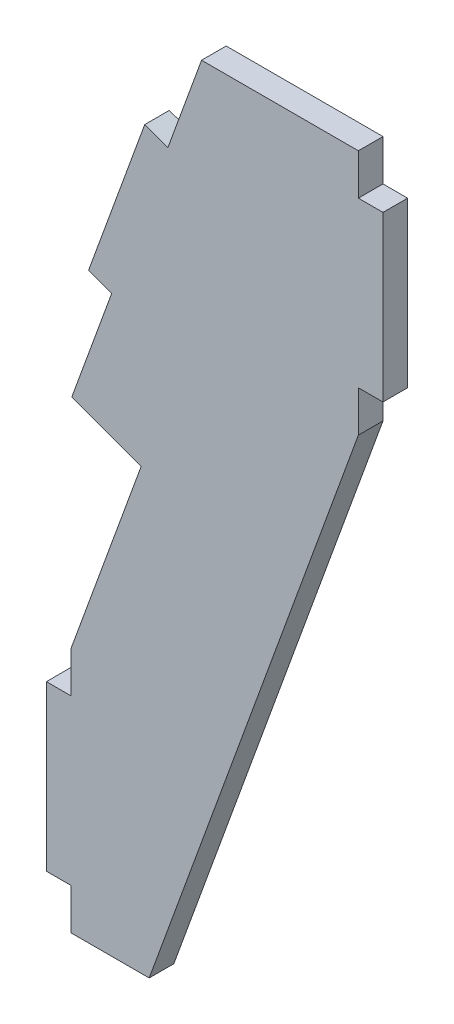
ISO-10303-21;
HEADER;
FILE_DESCRIPTION(('STEP AP214'),'2;1');
FILE_NAME('part.step','',(''),(''),'','','');
FILE_SCHEMA(('AUTOMOTIVE_DESIGN { 1 0 10303 214 1 1 1 1 }'));
ENDSEC;
DATA;
#1=APPLICATION_CONTEXT('core data for automotive mechanical design processes');
#2=APPLICATION_PROTOCOL_DEFINITION('international standard','automotive_design',2000,#1);
#3=PRODUCT_CONTEXT('',#1,'mechanical');
#4=PRODUCT('Part','Part','',(#3));
#5=PRODUCT_RELATED_PRODUCT_CATEGORY('part','',(#4));
#6=PRODUCT_DEFINITION_FORMATION('','',#4);
#7=PRODUCT_DEFINITION_CONTEXT('part definition',#1,'design');
#8=PRODUCT_DEFINITION('design','',#6,#7);
#9=PRODUCT_DEFINITION_SHAPE('','',#8);
#10=(LENGTH_UNIT() NAMED_UNIT(*) SI_UNIT(.MILLI.,.METRE.));
#11=(NAMED_UNIT(*) PLANE_ANGLE_UNIT() SI_UNIT($,.RADIAN.));
#12=(NAMED_UNIT(*) SI_UNIT($,.STERADIAN.) SOLID_ANGLE_UNIT());
#13=UNCERTAINTY_MEASURE_WITH_UNIT(LENGTH_MEASURE(1.E-05),#10,'distance_accuracy_value','');
#14=(GEOMETRIC_REPRESENTATION_CONTEXT(3) GLOBAL_UNCERTAINTY_ASSIGNED_CONTEXT((#13)) GLOBAL_UNIT_ASSIGNED_CONTEXT((#10,
#11,#12)) REPRESENTATION_CONTEXT('',''));
#15=CARTESIAN_POINT('',(0.,0.,0.));
#16=DIRECTION('',(0.,0.,1.));
#17=DIRECTION('',(1.,0.,0.));
#18=AXIS2_PLACEMENT_3D('',#15,#16,#17);
#19=CARTESIAN_POINT('',(3.,25.,3.));
#20=DIRECTION('',(1.,0.,0.));
#21=DIRECTION('',(0.,1.,0.));
#22=AXIS2_PLACEMENT_3D('',#19,#20,#21);
#23=PLANE('',#22);
#24=DIRECTION('',(0.,-1.,0.));
#25=VECTOR('',#24,1.);
#26=CARTESIAN_POINT('',(3.,25.,0.));
#27=LINE('',#26,#25);
#28=CARTESIAN_POINT('',(3.,25.,0.));
#29=VERTEX_POINT('',#28);
#30=CARTESIAN_POINT('',(3.,20.,0.));
#31=VERTEX_POINT('',#30);
#32=EDGE_CURVE('E184',#29,#31,#27,.T.);
#33=ORIENTED_EDGE('',*,*,#32,.T.);
#34=DIRECTION('',(0.,0.,-1.));
#35=VECTOR('',#34,1.);
#36=CARTESIAN_POINT('',(3.,20.,3.));
#37=LINE('',#36,#35);
#38=CARTESIAN_POINT('',(3.,20.,3.));
#39=VERTEX_POINT('',#38);
#40=EDGE_CURVE('E11',#39,#31,#37,.T.);
#41=ORIENTED_EDGE('',*,*,#40,.F.);
#42=DIRECTION('',(0.,-1.,0.));
#43=VECTOR('',#42,1.);
#44=CARTESIAN_POINT('',(3.,25.,3.));
#45=LINE('',#44,#43);
#46=CARTESIAN_POINT('',(3.,25.,3.));
#47=VERTEX_POINT('',#46);
#48=EDGE_CURVE('E212',#47,#39,#45,.T.);
#49=ORIENTED_EDGE('',*,*,#48,.F.);
#50=DIRECTION('',(0.,0.,-1.));
#51=VECTOR('',#50,1.);
#52=CARTESIAN_POINT('',(3.,25.,3.));
#53=LINE('',#52,#51);
#54=EDGE_CURVE('E183',#47,#29,#53,.T.);
#55=ORIENTED_EDGE('',*,*,#54,.T.);
#56=EDGE_LOOP('',(#33,#41,#49,#55));
#57=FACE_BOUND('',#56,.T.);
#58=ADVANCED_FACE('F35',(#57),#23,.F.);
#59=CARTESIAN_POINT('',(3.,20.,3.));
#60=DIRECTION('',(0.,-1.,0.));
#61=DIRECTION('',(1.,0.,0.));
#62=AXIS2_PLACEMENT_3D('',#59,#60,#61);
#63=PLANE('',#62);
#64=DIRECTION('',(-1.,0.,0.));
#65=VECTOR('',#64,1.);
#66=CARTESIAN_POINT('',(3.,20.,0.));
#67=LINE('',#66,#65);
#68=CARTESIAN_POINT('',(0.,20.,0.));
#69=VERTEX_POINT('',#68);
#70=EDGE_CURVE('E187',#31,#69,#67,.T.);
#71=ORIENTED_EDGE('',*,*,#70,.T.);
#72=DIRECTION('',(0.,0.,-1.));
#73=VECTOR('',#72,1.);
#74=CARTESIAN_POINT('',(0.,20.,3.));
#75=LINE('',#74,#73);
#76=CARTESIAN_POINT('',(0.,20.,3.));
#77=VERTEX_POINT('',#76);
#78=EDGE_CURVE('E43',#77,#69,#75,.T.);
#79=ORIENTED_EDGE('',*,*,#78,.F.);
#80=DIRECTION('',(-1.,0.,0.));
#81=VECTOR('',#80,1.);
#82=CARTESIAN_POINT('',(3.,20.,3.));
#83=LINE('',#82,#81);
#84=EDGE_CURVE('E113',#39,#77,#83,.T.);
#85=ORIENTED_EDGE('',*,*,#84,.F.);
#86=ORIENTED_EDGE('',*,*,#40,.T.);
#87=EDGE_LOOP('',(#71,#79,#85,#86));
#88=FACE_BOUND('',#87,.T.);
#89=ADVANCED_FACE('F318',(#88),#63,.F.);
#90=CARTESIAN_POINT('',(0.,20.,3.));
#91=DIRECTION('',(1.,0.,0.));
#92=DIRECTION('',(0.,1.,0.));
#93=AXIS2_PLACEMENT_3D('',#90,#91,#92);
#94=PLANE('',#93);
#95=DIRECTION('',(0.,-1.,0.));
#96=VECTOR('',#95,1.);
#97=CARTESIAN_POINT('',(0.,20.,0.));
#98=LINE('',#97,#96);
#99=CARTESIAN_POINT('',(0.,0.,0.));
#100=VERTEX_POINT('',#99);
#101=EDGE_CURVE('E189',#69,#100,#98,.T.);
#102=ORIENTED_EDGE('',*,*,#101,.T.);
#103=DIRECTION('',(0.,0.,-1.));
#104=VECTOR('',#103,1.);
#105=CARTESIAN_POINT('',(0.,0.,3.));
#106=LINE('',#105,#104);
#107=CARTESIAN_POINT('',(0.,0.,3.));
#108=VERTEX_POINT('',#107);
#109=EDGE_CURVE('E237',#108,#100,#106,.T.);
#110=ORIENTED_EDGE('',*,*,#109,.F.);
#111=DIRECTION('',(0.,-1.,0.));
#112=VECTOR('',#111,1.);
#113=CARTESIAN_POINT('',(0.,20.,3.));
#114=LINE('',#113,#112);
#115=EDGE_CURVE('E245',#77,#108,#114,.T.);
#116=ORIENTED_EDGE('',*,*,#115,.F.);
#117=ORIENTED_EDGE('',*,*,#78,.T.);
#118=EDGE_LOOP('',(#102,#110,#116,#117));
#119=FACE_BOUND('',#118,.T.);
#120=ADVANCED_FACE('F243',(#119),#94,.F.);
#121=CARTESIAN_POINT('',(0.,0.,3.));
#122=DIRECTION('',(0.,1.,0.));
#123=DIRECTION('',(0.,0.,1.));
#124=AXIS2_PLACEMENT_3D('',#121,#122,#123);
#125=PLANE('',#124);
#126=DIRECTION('',(1.,0.,0.));
#127=VECTOR('',#126,1.);
#128=CARTESIAN_POINT('',(0.,0.,0.));
#129=LINE('',#128,#127);
#130=CARTESIAN_POINT('',(3.,0.,0.));
#131=VERTEX_POINT('',#130);
#132=EDGE_CURVE('E191',#100,#131,#129,.T.);
#133=ORIENTED_EDGE('',*,*,#132,.T.);
#134=DIRECTION('',(0.,0.,-1.));
#135=VECTOR('',#134,1.);
#136=CARTESIAN_POINT('',(3.,0.,3.));
#137=LINE('',#136,#135);
#138=CARTESIAN_POINT('',(3.,0.,3.));
#139=VERTEX_POINT('',#138);
#140=EDGE_CURVE('E234',#139,#131,#137,.T.);
#141=ORIENTED_EDGE('',*,*,#140,.F.);
#142=DIRECTION('',(1.,0.,0.));
#143=VECTOR('',#142,1.);
#144=CARTESIAN_POINT('',(0.,0.,3.));
#145=LINE('',#144,#143);
#146=EDGE_CURVE('E263',#108,#139,#145,.T.);
#147=ORIENTED_EDGE('',*,*,#146,.F.);
#148=ORIENTED_EDGE('',*,*,#109,.T.);
#149=EDGE_LOOP('',(#133,#141,#147,#148));
#150=FACE_BOUND('',#149,.T.);
#151=ADVANCED_FACE('F254',(#150),#125,.F.);
#152=CARTESIAN_POINT('',(3.,0.,3.));
#153=DIRECTION('',(1.,0.,0.));
#154=DIRECTION('',(0.,1.,0.));
#155=AXIS2_PLACEMENT_3D('',#152,#153,#154);
#156=PLANE('',#155);
#157=DIRECTION('',(0.,-1.,0.));
#158=VECTOR('',#157,1.);
#159=CARTESIAN_POINT('',(3.,0.,0.));
#160=LINE('',#159,#158);
#161=CARTESIAN_POINT('',(3.,-5.,0.));
#162=VERTEX_POINT('',#161);
#163=EDGE_CURVE('E193',#131,#162,#160,.T.);
#164=ORIENTED_EDGE('',*,*,#163,.T.);
#165=DIRECTION('',(0.,0.,-1.));
#166=VECTOR('',#165,1.);
#167=CARTESIAN_POINT('',(3.,-5.,3.));
#168=LINE('',#167,#166);
#169=CARTESIAN_POINT('',(3.,-5.,3.));
#170=VERTEX_POINT('',#169);
#171=EDGE_CURVE('E231',#170,#162,#168,.T.);
#172=ORIENTED_EDGE('',*,*,#171,.F.);
#173=DIRECTION('',(0.,-1.,0.));
#174=VECTOR('',#173,1.);
#175=CARTESIAN_POINT('',(3.,0.,3.));
#176=LINE('',#175,#174);
#177=EDGE_CURVE('E260',#139,#170,#176,.T.);
#178=ORIENTED_EDGE('',*,*,#177,.F.);
#179=ORIENTED_EDGE('',*,*,#140,.T.);
#180=EDGE_LOOP('',(#164,#172,#178,#179));
#181=FACE_BOUND('',#180,.T.);
#182=ADVANCED_FACE('F258',(#181),#156,.F.);
#183=CARTESIAN_POINT('',(3.,-5.,3.));
#184=DIRECTION('',(0.,1.,0.));
#185=DIRECTION('',(0.,0.,1.));
#186=AXIS2_PLACEMENT_3D('',#183,#184,#185);
#187=PLANE('',#186);
#188=DIRECTION('',(1.,0.,0.));
#189=VECTOR('',#188,1.);
#190=CARTESIAN_POINT('',(3.,-5.,0.));
#191=LINE('',#190,#189);
#192=CARTESIAN_POINT('',(12.5220836022957,-5.,0.));
#193=VERTEX_POINT('',#192);
#194=EDGE_CURVE('E195',#162,#193,#191,.T.);
#195=ORIENTED_EDGE('',*,*,#194,.T.);
#196=DIRECTION('',(0.,0.,-1.));
#197=VECTOR('',#196,1.);
#198=CARTESIAN_POINT('',(12.5220836022957,-5.,3.));
#199=LINE('',#198,#197);
#200=CARTESIAN_POINT('',(12.5220836022957,-5.,3.));
#201=VERTEX_POINT('',#200);
#202=EDGE_CURVE('E228',#201,#193,#199,.T.);
#203=ORIENTED_EDGE('',*,*,#202,.F.);
#204=DIRECTION('',(1.,0.,0.));
#205=VECTOR('',#204,1.);
#206=CARTESIAN_POINT('',(3.,-5.,3.));
#207=LINE('',#206,#205);
#208=EDGE_CURVE('E262',#170,#201,#207,.T.);
#209=ORIENTED_EDGE('',*,*,#208,.F.);
#210=ORIENTED_EDGE('',*,*,#171,.T.);
#211=EDGE_LOOP('',(#195,#203,#209,#210));
#212=FACE_BOUND('',#211,.T.);
#213=ADVANCED_FACE('F330',(#212),#187,.F.);
#214=CARTESIAN_POINT('',(12.5220836022957,-5.,3.));
#215=DIRECTION('',(-0.939692620785908,0.342020143325669,0.));
#216=DIRECTION('',(-0.342020143325669,-0.939692620785908,0.));
#217=AXIS2_PLACEMENT_3D('',#214,#215,#216);
#218=PLANE('',#217);
#219=DIRECTION('',(0.342020143325669,0.939692620785908,0.));
#220=VECTOR('',#219,1.);
#221=CARTESIAN_POINT('',(12.5220836022957,-5.,0.));
#222=LINE('',#221,#220);
#223=CARTESIAN_POINT('',(38.0000000009301,65.0000000000005,0.));
#224=VERTEX_POINT('',#223);
#225=EDGE_CURVE('E197',#193,#224,#222,.T.);
#226=ORIENTED_EDGE('',*,*,#225,.T.);
#227=DIRECTION('',(0.,0.,-1.));
#228=VECTOR('',#227,1.);
#229=CARTESIAN_POINT('',(38.0000000009301,65.0000000000005,3.));
#230=LINE('',#229,#228);
#231=CARTESIAN_POINT('',(38.0000000009301,65.0000000000005,3.));
#232=VERTEX_POINT('',#231);
#233=EDGE_CURVE('E225',#232,#224,#230,.T.);
#234=ORIENTED_EDGE('',*,*,#233,.F.);
#235=DIRECTION('',(0.342020143325669,0.939692620785908,0.));
#236=VECTOR('',#235,1.);
#237=CARTESIAN_POINT('',(12.5220836022957,-5.,3.));
#238=LINE('',#237,#236);
#239=EDGE_CURVE('E265',#201,#232,#238,.T.);
#240=ORIENTED_EDGE('',*,*,#239,.F.);
#241=ORIENTED_EDGE('',*,*,#202,.T.);
#242=EDGE_LOOP('',(#226,#234,#240,#241));
#243=FACE_BOUND('',#242,.T.);
#244=ADVANCED_FACE('F333',(#243),#218,.F.);
#245=CARTESIAN_POINT('',(38.0000000009301,65.0000000000005,3.));
#246=DIRECTION('',(-1.,0.,0.));
#247=DIRECTION('',(0.,0.,1.));
#248=AXIS2_PLACEMENT_3D('',#245,#246,#247);
#249=PLANE('',#248);
#250=DIRECTION('',(0.,1.,0.));
#251=VECTOR('',#250,1.);
#252=CARTESIAN_POINT('',(38.0000000009301,65.0000000000005,0.));
#253=LINE('',#252,#251);
#254=CARTESIAN_POINT('',(38.0000000009301,70.0000000000004,0.));
#255=VERTEX_POINT('',#254);
#256=EDGE_CURVE('E199',#224,#255,#253,.T.);
#257=ORIENTED_EDGE('',*,*,#256,.T.);
#258=DIRECTION('',(0.,0.,-1.));
#259=VECTOR('',#258,1.);
#260=CARTESIAN_POINT('',(38.0000000009301,70.0000000000004,3.));
#261=LINE('',#260,#259);
#262=CARTESIAN_POINT('',(38.0000000009301,70.0000000000004,3.));
#263=VERTEX_POINT('',#262);
#264=EDGE_CURVE('E222',#263,#255,#261,.T.);
#265=ORIENTED_EDGE('',*,*,#264,.F.);
#266=DIRECTION('',(0.,1.,0.));
#267=VECTOR('',#266,1.);
#268=CARTESIAN_POINT('',(38.0000000009301,65.0000000000005,3.));
#269=LINE('',#268,#267);
#270=EDGE_CURVE('E271',#232,#263,#269,.T.);
#271=ORIENTED_EDGE('',*,*,#270,.F.);
#272=ORIENTED_EDGE('',*,*,#233,.T.);
#273=EDGE_LOOP('',(#257,#265,#271,#272));
#274=FACE_BOUND('',#273,.T.);
#275=ADVANCED_FACE('F337',(#274),#249,.F.);
#276=CARTESIAN_POINT('',(38.0000000009301,70.0000000000004,3.));
#277=DIRECTION('',(0.,1.,0.));
#278=DIRECTION('',(0.,0.,1.));
#279=AXIS2_PLACEMENT_3D('',#276,#277,#278);
#280=PLANE('',#279);
#281=DIRECTION('',(1.,0.,0.));
#282=VECTOR('',#281,1.);
#283=CARTESIAN_POINT('',(38.0000000009301,70.0000000000004,0.));
#284=LINE('',#283,#282);
#285=CARTESIAN_POINT('',(41.,70.0000000000004,0.));
#286=VERTEX_POINT('',#285);
#287=EDGE_CURVE('E201',#255,#286,#284,.T.);
#288=ORIENTED_EDGE('',*,*,#287,.T.);
#289=DIRECTION('',(0.,0.,-1.));
#290=VECTOR('',#289,1.);
#291=CARTESIAN_POINT('',(41.,70.0000000000004,3.));
#292=LINE('',#291,#290);
#293=CARTESIAN_POINT('',(41.,70.0000000000004,3.));
#294=VERTEX_POINT('',#293);
#295=EDGE_CURVE('E219',#294,#286,#292,.T.);
#296=ORIENTED_EDGE('',*,*,#295,.F.);
#297=DIRECTION('',(1.,0.,0.));
#298=VECTOR('',#297,1.);
#299=CARTESIAN_POINT('',(38.0000000009301,70.0000000000004,3.));
#300=LINE('',#299,#298);
#301=EDGE_CURVE('E273',#263,#294,#300,.T.);
#302=ORIENTED_EDGE('',*,*,#301,.F.);
#303=ORIENTED_EDGE('',*,*,#264,.T.);
#304=EDGE_LOOP('',(#288,#296,#302,#303));
#305=FACE_BOUND('',#304,.T.);
#306=ADVANCED_FACE('F341',(#305),#280,.F.);
#307=CARTESIAN_POINT('',(41.,70.0000000000004,3.));
#308=DIRECTION('',(-1.,0.,0.));
#309=DIRECTION('',(0.,-1.,0.));
#310=AXIS2_PLACEMENT_3D('',#307,#308,#309);
#311=PLANE('',#310);
#312=DIRECTION('',(0.,1.,0.));
#313=VECTOR('',#312,1.);
#314=CARTESIAN_POINT('',(41.,70.0000000000004,0.));
#315=LINE('',#314,#313);
#316=CARTESIAN_POINT('',(41.,89.9999999965894,0.));
#317=VERTEX_POINT('',#316);
#318=EDGE_CURVE('E203',#286,#317,#315,.T.);
#319=ORIENTED_EDGE('',*,*,#318,.T.);
#320=DIRECTION('',(0.,0.,-1.));
#321=VECTOR('',#320,1.);
#322=CARTESIAN_POINT('',(41.,89.9999999965894,3.));
#323=LINE('',#322,#321);
#324=CARTESIAN_POINT('',(41.,89.9999999965894,3.));
#325=VERTEX_POINT('',#324);
#326=EDGE_CURVE('E216',#325,#317,#323,.T.);
#327=ORIENTED_EDGE('',*,*,#326,.F.);
#328=DIRECTION('',(0.,1.,0.));
#329=VECTOR('',#328,1.);
#330=CARTESIAN_POINT('',(41.,70.0000000000004,3.));
#331=LINE('',#330,#329);
#332=EDGE_CURVE('E275',#294,#325,#331,.T.);
#333=ORIENTED_EDGE('',*,*,#332,.F.);
#334=ORIENTED_EDGE('',*,*,#295,.T.);
#335=EDGE_LOOP('',(#319,#327,#333,#334));
#336=FACE_BOUND('',#335,.T.);
#337=ADVANCED_FACE('F281',(#336),#311,.F.);
#338=CARTESIAN_POINT('',(41.,89.9999999965894,3.));
#339=DIRECTION('',(0.,-1.,0.));
#340=DIRECTION('',(1.,0.,0.));
#341=AXIS2_PLACEMENT_3D('',#338,#339,#340);
#342=PLANE('',#341);
#343=DIRECTION('',(-1.,0.,0.));
#344=VECTOR('',#343,1.);
#345=CARTESIAN_POINT('',(41.,89.9999999965894,0.));
#346=LINE('',#345,#344);
#347=CARTESIAN_POINT('',(38.0000000009301,89.9999999965894,0.));
#348=VERTEX_POINT('',#347);
#349=EDGE_CURVE('E205',#317,#348,#346,.T.);
#350=ORIENTED_EDGE('',*,*,#349,.T.);
#351=DIRECTION('',(0.,0.,-1.));
#352=VECTOR('',#351,1.);
#353=CARTESIAN_POINT('',(38.0000000009301,89.9999999965894,3.));
#354=LINE('',#353,#352);
#355=CARTESIAN_POINT('',(38.0000000009301,89.9999999965894,3.));
#356=VERTEX_POINT('',#355);
#357=EDGE_CURVE('E170',#356,#348,#354,.T.);
#358=ORIENTED_EDGE('',*,*,#357,.F.);
#359=DIRECTION('',(-1.,0.,0.));
#360=VECTOR('',#359,1.);
#361=CARTESIAN_POINT('',(41.,89.9999999965894,3.));
#362=LINE('',#361,#360);
#363=EDGE_CURVE('E157',#325,#356,#362,.T.);
#364=ORIENTED_EDGE('',*,*,#363,.F.);
#365=ORIENTED_EDGE('',*,*,#326,.T.);
#366=EDGE_LOOP('',(#350,#358,#364,#365));
#367=FACE_BOUND('',#366,.T.);
#368=ADVANCED_FACE('F285',(#367),#342,.F.);
#369=CARTESIAN_POINT('',(38.0000000009301,89.9999999965894,3.));
#370=DIRECTION('',(-1.,0.,0.));
#371=DIRECTION('',(0.,0.,1.));
#372=AXIS2_PLACEMENT_3D('',#369,#370,#371);
#373=PLANE('',#372);
#374=DIRECTION('',(0.,1.,0.));
#375=VECTOR('',#374,1.);
#376=CARTESIAN_POINT('',(38.0000000009301,89.9999999965894,0.));
#377=LINE('',#376,#375);
#378=CARTESIAN_POINT('',(38.0000000009301,94.9999999965894,0.));
#379=VERTEX_POINT('',#378);
#380=EDGE_CURVE('E166',#348,#379,#377,.T.);
#381=ORIENTED_EDGE('',*,*,#380,.T.);
#382=DIRECTION('',(0.,0.,-1.));
#383=VECTOR('',#382,1.);
#384=CARTESIAN_POINT('',(38.0000000009301,94.9999999965894,3.));
#385=LINE('',#384,#383);
#386=CARTESIAN_POINT('',(38.0000000009301,94.9999999965894,3.));
#387=VERTEX_POINT('',#386);
#388=EDGE_CURVE('E163',#387,#379,#385,.T.);
#389=ORIENTED_EDGE('',*,*,#388,.F.);
#390=DIRECTION('',(0.,1.,0.));
#391=VECTOR('',#390,1.);
#392=CARTESIAN_POINT('',(38.0000000009301,89.9999999965894,3.));
#393=LINE('',#392,#391);
#394=EDGE_CURVE('E148',#356,#387,#393,.T.);
#395=ORIENTED_EDGE('',*,*,#394,.F.);
#396=ORIENTED_EDGE('',*,*,#357,.T.);
#397=EDGE_LOOP('',(#381,#389,#395,#396));
#398=FACE_BOUND('',#397,.T.);
#399=ADVANCED_FACE('F164',(#398),#373,.F.);
#400=CARTESIAN_POINT('',(38.0000000009301,94.9999999965894,3.));
#401=DIRECTION('',(0.,-1.,0.));
#402=DIRECTION('',(0.,0.,-1.));
#403=AXIS2_PLACEMENT_3D('',#400,#401,#402);
#404=PLANE('',#403);
#405=DIRECTION('',(-1.,0.,0.));
#406=VECTOR('',#405,1.);
#407=CARTESIAN_POINT('',(38.0000000009301,94.9999999965894,0.));
#408=LINE('',#407,#406);
#409=CARTESIAN_POINT('',(18.9003164451097,94.9999999965894,0.));
#410=VERTEX_POINT('',#409);
#411=EDGE_CURVE('E208',#379,#410,#408,.T.);
#412=ORIENTED_EDGE('',*,*,#411,.T.);
#413=DIRECTION('',(0.,0.,-1.));
#414=VECTOR('',#413,1.);
#415=CARTESIAN_POINT('',(18.9003164451097,94.9999999965894,3.));
#416=LINE('',#415,#414);
#417=CARTESIAN_POINT('',(18.9003164451097,94.9999999965894,3.));
#418=VERTEX_POINT('',#417);
#419=EDGE_CURVE('E175',#418,#410,#416,.T.);
#420=ORIENTED_EDGE('',*,*,#419,.F.);
#421=DIRECTION('',(-1.,0.,0.));
#422=VECTOR('',#421,1.);
#423=CARTESIAN_POINT('',(38.0000000009301,94.9999999965894,3.));
#424=LINE('',#423,#422);
#425=EDGE_CURVE('E154',#387,#418,#424,.T.);
#426=ORIENTED_EDGE('',*,*,#425,.F.);
#427=ORIENTED_EDGE('',*,*,#388,.T.);
#428=EDGE_LOOP('',(#412,#420,#426,#427));
#429=FACE_BOUND('',#428,.T.);
#430=ADVANCED_FACE('F173',(#429),#404,.F.);
#431=CARTESIAN_POINT('',(8.73142572313329,49.5183759487696,3.));
#432=DIRECTION('',(0.342020143325669,0.939692620785909,0.));
#433=DIRECTION('',(-0.939692620785909,0.342020143325669,0.));
#434=AXIS2_PLACEMENT_3D('',#431,#432,#433);
#435=PLANE('',#434);
#436=DIRECTION('',(0.939692620785908,-0.342020143325669,0.));
#437=VECTOR('',#436,1.);
#438=CARTESIAN_POINT('',(8.73142572313329,49.5183759487696,0.));
#439=LINE('',#438,#437);
#440=CARTESIAN_POINT('',(3.09326999606862,51.5704968095787,0.));
#441=VERTEX_POINT('',#440);
#442=CARTESIAN_POINT('',(11.5505035831417,48.4923155196477,0.));
#443=VERTEX_POINT('',#442);
#444=EDGE_CURVE('E99',#441,#443,#439,.T.);
#445=ORIENTED_EDGE('',*,*,#444,.T.);
#446=DIRECTION('',(0.,0.,-1.));
#447=VECTOR('',#446,1.);
#448=CARTESIAN_POINT('',(11.5505035831417,48.4923155196477,3.));
#449=LINE('',#448,#447);
#450=CARTESIAN_POINT('',(11.5505035831417,48.4923155196477,3.));
#451=VERTEX_POINT('',#450);
#452=EDGE_CURVE('E171',#451,#443,#449,.T.);
#453=ORIENTED_EDGE('',*,*,#452,.F.);
#454=DIRECTION('',(0.939692620785908,-0.342020143325669,0.));
#455=VECTOR('',#454,1.);
#456=CARTESIAN_POINT('',(8.73142572313329,49.5183759487696,3.));
#457=LINE('',#456,#455);
#458=CARTESIAN_POINT('',(3.09326999606862,51.5704968095787,3.));
#459=VERTEX_POINT('',#458);
#460=EDGE_CURVE('E177',#459,#451,#457,.T.);
#461=ORIENTED_EDGE('',*,*,#460,.F.);
#462=DIRECTION('',(0.,0.,-1.));
#463=VECTOR('',#462,1.);
#464=CARTESIAN_POINT('',(3.09326999606862,51.5704968095787,3.));
#465=LINE('',#464,#463);
#466=EDGE_CURVE('E312',#459,#441,#465,.T.);
#467=ORIENTED_EDGE('',*,*,#466,.T.);
#468=EDGE_LOOP('',(#445,#453,#461,#467));
#469=FACE_BOUND('',#468,.T.);
#470=ADVANCED_FACE('F354',(#469),#435,.F.);
#471=CARTESIAN_POINT('',(11.5505035831417,48.4923155196477,3.));
#472=DIRECTION('',(0.939692620785908,-0.342020143325669,0.));
#473=DIRECTION('',(0.342020143325669,0.939692620785908,0.));
#474=AXIS2_PLACEMENT_3D('',#471,#472,#473);
#475=PLANE('',#474);
#476=DIRECTION('',(-0.342020143325669,-0.939692620785908,0.));
#477=VECTOR('',#476,1.);
#478=CARTESIAN_POINT('',(11.5505035831417,48.4923155196477,0.));
#479=LINE('',#478,#477);
#480=EDGE_CURVE('E105',#443,#29,#479,.T.);
#481=ORIENTED_EDGE('',*,*,#480,.T.);
#482=ORIENTED_EDGE('',*,*,#54,.F.);
#483=DIRECTION('',(-0.342020143325669,-0.939692620785908,0.));
#484=VECTOR('',#483,1.);
#485=CARTESIAN_POINT('',(11.5505035831417,48.4923155196477,3.));
#486=LINE('',#485,#484);
#487=EDGE_CURVE('E51',#451,#47,#486,.T.);
#488=ORIENTED_EDGE('',*,*,#487,.F.);
#489=ORIENTED_EDGE('',*,*,#452,.T.);
#490=EDGE_LOOP('',(#481,#482,#488,#489));
#491=FACE_BOUND('',#490,.T.);
#492=ADVANCED_FACE('F357',(#491),#475,.F.);
#493=CARTESIAN_POINT('',(0.,0.,3.));
#494=DIRECTION('',(0.,0.,-1.));
#495=DIRECTION('',(-1.,0.,0.));
#496=AXIS2_PLACEMENT_3D('',#493,#494,#495);
#497=PLANE('',#496);
#498=DIRECTION('',(0.342020143325668,0.939692620785909,0.));
#499=VECTOR('',#498,1.);
#500=CARTESIAN_POINT('',(7.95567185868829,64.9298361314404,3.));
#501=LINE('',#500,#499);
#502=CARTESIAN_POINT('',(7.95567185868829,64.9298361314404,3.));
#503=VERTEX_POINT('',#502);
#504=EDGE_CURVE('E554',#459,#503,#501,.T.);
#505=ORIENTED_EDGE('',*,*,#504,.F.);
#506=ORIENTED_EDGE('',*,*,#460,.T.);
#507=ORIENTED_EDGE('',*,*,#487,.T.);
#508=ORIENTED_EDGE('',*,*,#48,.T.);
#509=ORIENTED_EDGE('',*,*,#84,.T.);
#510=ORIENTED_EDGE('',*,*,#115,.T.);
#511=ORIENTED_EDGE('',*,*,#146,.T.);
#512=ORIENTED_EDGE('',*,*,#177,.T.);
#513=ORIENTED_EDGE('',*,*,#208,.T.);
#514=ORIENTED_EDGE('',*,*,#239,.T.);
#515=ORIENTED_EDGE('',*,*,#270,.T.);
#516=ORIENTED_EDGE('',*,*,#301,.T.);
#517=ORIENTED_EDGE('',*,*,#332,.T.);
#518=ORIENTED_EDGE('',*,*,#363,.T.);
#519=ORIENTED_EDGE('',*,*,#394,.T.);
#520=ORIENTED_EDGE('',*,*,#425,.T.);
#521=DIRECTION('',(0.342020143325668,0.939692620785909,0.));
#522=VECTOR('',#521,1.);
#523=CARTESIAN_POINT('',(14.7960747252017,83.7236885471585,3.));
#524=LINE('',#523,#522);
#525=CARTESIAN_POINT('',(14.7960747252017,83.7236885471585,3.));
#526=VERTEX_POINT('',#525);
#527=EDGE_CURVE('E295',#526,#418,#524,.T.);
#528=ORIENTED_EDGE('',*,*,#527,.F.);
#529=DIRECTION('',(0.939692620785908,-0.342020143325669,0.));
#530=VECTOR('',#529,1.);
#531=CARTESIAN_POINT('',(11.9769968628439,84.7497489771355,3.));
#532=LINE('',#531,#530);
#533=CARTESIAN_POINT('',(11.9769968628439,84.7497489771355,3.));
#534=VERTEX_POINT('',#533);
#535=EDGE_CURVE('E546',#534,#526,#532,.T.);
#536=ORIENTED_EDGE('',*,*,#535,.F.);
#537=DIRECTION('',(0.342020143325668,0.939692620785909,0.));
#538=VECTOR('',#537,1.);
#539=CARTESIAN_POINT('',(5.13659399633057,65.9558965614174,3.));
#540=LINE('',#539,#538);
#541=CARTESIAN_POINT('',(5.13659399633057,65.9558965614174,3.));
#542=VERTEX_POINT('',#541);
#543=EDGE_CURVE('E548',#542,#534,#540,.T.);
#544=ORIENTED_EDGE('',*,*,#543,.F.);
#545=DIRECTION('',(-0.939692620785908,0.34202014332567,0.));
#546=VECTOR('',#545,1.);
#547=CARTESIAN_POINT('',(7.95567185868829,64.9298361314404,3.));
#548=LINE('',#547,#546);
#549=EDGE_CURVE('E551',#503,#542,#548,.T.);
#550=ORIENTED_EDGE('',*,*,#549,.F.);
#551=EDGE_LOOP('',(#505,#506,#507,#508,#509,#510,#511,#512,#513,#514,#515,#516,#517,#518,#519,
#520,#528,#536,#544,#550));
#552=FACE_BOUND('',#551,.T.);
#553=ADVANCED_FACE('F151',(#552),#497,.F.);
#554=CARTESIAN_POINT('',(0.,0.,0.));
#555=DIRECTION('',(0.,0.,-1.));
#556=DIRECTION('',(-1.,0.,0.));
#557=AXIS2_PLACEMENT_3D('',#554,#555,#556);
#558=PLANE('',#557);
#559=ORIENTED_EDGE('',*,*,#444,.F.);
#560=DIRECTION('',(0.342020143325668,0.939692620785909,0.));
#561=VECTOR('',#560,1.);
#562=CARTESIAN_POINT('',(7.95567185868829,64.9298361314404,0.));
#563=LINE('',#562,#561);
#564=CARTESIAN_POINT('',(7.95567185868829,64.9298361314404,0.));
#565=VERTEX_POINT('',#564);
#566=EDGE_CURVE('E541',#441,#565,#563,.T.);
#567=ORIENTED_EDGE('',*,*,#566,.T.);
#568=DIRECTION('',(-0.939692620785908,0.34202014332567,0.));
#569=VECTOR('',#568,1.);
#570=CARTESIAN_POINT('',(7.95567185868829,64.9298361314404,0.));
#571=LINE('',#570,#569);
#572=CARTESIAN_POINT('',(5.13659399633057,65.9558965614174,0.));
#573=VERTEX_POINT('',#572);
#574=EDGE_CURVE('E538',#565,#573,#571,.T.);
#575=ORIENTED_EDGE('',*,*,#574,.T.);
#576=DIRECTION('',(0.342020143325668,0.939692620785909,0.));
#577=VECTOR('',#576,1.);
#578=CARTESIAN_POINT('',(5.13659399633057,65.9558965614174,0.));
#579=LINE('',#578,#577);
#580=CARTESIAN_POINT('',(11.9769968628439,84.7497489771355,0.));
#581=VERTEX_POINT('',#580);
#582=EDGE_CURVE('E533',#573,#581,#579,.T.);
#583=ORIENTED_EDGE('',*,*,#582,.T.);
#584=DIRECTION('',(0.939692620785908,-0.342020143325669,0.));
#585=VECTOR('',#584,1.);
#586=CARTESIAN_POINT('',(11.9769968628439,84.7497489771355,0.));
#587=LINE('',#586,#585);
#588=CARTESIAN_POINT('',(14.7960747252017,83.7236885471585,0.));
#589=VERTEX_POINT('',#588);
#590=EDGE_CURVE('E526',#581,#589,#587,.T.);
#591=ORIENTED_EDGE('',*,*,#590,.T.);
#592=DIRECTION('',(0.342020143325668,0.939692620785909,0.));
#593=VECTOR('',#592,1.);
#594=CARTESIAN_POINT('',(14.7960747252017,83.7236885471585,0.));
#595=LINE('',#594,#593);
#596=EDGE_CURVE('E289',#589,#410,#595,.T.);
#597=ORIENTED_EDGE('',*,*,#596,.T.);
#598=ORIENTED_EDGE('',*,*,#411,.F.);
#599=ORIENTED_EDGE('',*,*,#380,.F.);
#600=ORIENTED_EDGE('',*,*,#349,.F.);
#601=ORIENTED_EDGE('',*,*,#318,.F.);
#602=ORIENTED_EDGE('',*,*,#287,.F.);
#603=ORIENTED_EDGE('',*,*,#256,.F.);
#604=ORIENTED_EDGE('',*,*,#225,.F.);
#605=ORIENTED_EDGE('',*,*,#194,.F.);
#606=ORIENTED_EDGE('',*,*,#163,.F.);
#607=ORIENTED_EDGE('',*,*,#132,.F.);
#608=ORIENTED_EDGE('',*,*,#101,.F.);
#609=ORIENTED_EDGE('',*,*,#70,.F.);
#610=ORIENTED_EDGE('',*,*,#32,.F.);
#611=ORIENTED_EDGE('',*,*,#480,.F.);
#612=EDGE_LOOP('',(#559,#567,#575,#583,#591,#597,#598,#599,#600,#601,#602,#603,#604,#605,#606,
#607,#608,#609,#610,#611));
#613=FACE_BOUND('',#612,.T.);
#614=ADVANCED_FACE('F248',(#613),#558,.T.);
#615=CARTESIAN_POINT('',(14.7960747252017,83.7236885471585,3.));
#616=DIRECTION('',(-0.939692620785909,0.342020143325668,0.));
#617=DIRECTION('',(-0.342020143325668,-0.939692620785909,0.));
#618=AXIS2_PLACEMENT_3D('',#615,#616,#617);
#619=PLANE('',#618);
#620=ORIENTED_EDGE('',*,*,#596,.F.);
#621=DIRECTION('',(0.,0.,-1.));
#622=VECTOR('',#621,1.);
#623=CARTESIAN_POINT('',(14.7960747252017,83.7236885471585,3.));
#624=LINE('',#623,#622);
#625=EDGE_CURVE('E296',#526,#589,#624,.T.);
#626=ORIENTED_EDGE('',*,*,#625,.F.);
#627=ORIENTED_EDGE('',*,*,#527,.T.);
#628=ORIENTED_EDGE('',*,*,#419,.T.);
#629=EDGE_LOOP('',(#620,#626,#627,#628));
#630=FACE_BOUND('',#629,.T.);
#631=ADVANCED_FACE('F293',(#630),#619,.T.);
#632=CARTESIAN_POINT('',(11.9769968628439,84.7497489771355,3.));
#633=DIRECTION('',(0.342020143325669,0.939692620785908,0.));
#634=DIRECTION('',(-0.939692620785908,0.342020143325669,0.));
#635=AXIS2_PLACEMENT_3D('',#632,#633,#634);
#636=PLANE('',#635);
#637=ORIENTED_EDGE('',*,*,#590,.F.);
#638=DIRECTION('',(0.,0.,-1.));
#639=VECTOR('',#638,1.);
#640=CARTESIAN_POINT('',(11.9769968628439,84.7497489771355,3.));
#641=LINE('',#640,#639);
#642=EDGE_CURVE('E299',#534,#581,#641,.T.);
#643=ORIENTED_EDGE('',*,*,#642,.F.);
#644=ORIENTED_EDGE('',*,*,#535,.T.);
#645=ORIENTED_EDGE('',*,*,#625,.T.);
#646=EDGE_LOOP('',(#637,#643,#644,#645));
#647=FACE_BOUND('',#646,.T.);
#648=ADVANCED_FACE('F375',(#647),#636,.T.);
#649=CARTESIAN_POINT('',(5.13659399633057,65.9558965614174,3.));
#650=DIRECTION('',(-0.939692620785909,0.342020143325668,0.));
#651=DIRECTION('',(-0.342020143325668,-0.939692620785909,0.));
#652=AXIS2_PLACEMENT_3D('',#649,#650,#651);
#653=PLANE('',#652);
#654=ORIENTED_EDGE('',*,*,#582,.F.);
#655=DIRECTION('',(0.,0.,-1.));
#656=VECTOR('',#655,1.);
#657=CARTESIAN_POINT('',(5.13659399633057,65.9558965614174,3.));
#658=LINE('',#657,#656);
#659=EDGE_CURVE('E306',#542,#573,#658,.T.);
#660=ORIENTED_EDGE('',*,*,#659,.F.);
#661=ORIENTED_EDGE('',*,*,#543,.T.);
#662=ORIENTED_EDGE('',*,*,#642,.T.);
#663=EDGE_LOOP('',(#654,#660,#661,#662));
#664=FACE_BOUND('',#663,.T.);
#665=ADVANCED_FACE('F371',(#664),#653,.T.);
#666=CARTESIAN_POINT('',(7.95567185868829,64.9298361314404,3.));
#667=DIRECTION('',(-0.34202014332567,-0.939692620785908,0.));
#668=DIRECTION('',(0.939692620785908,-0.34202014332567,0.));
#669=AXIS2_PLACEMENT_3D('',#666,#667,#668);
#670=PLANE('',#669);
#671=ORIENTED_EDGE('',*,*,#574,.F.);
#672=DIRECTION('',(0.,0.,-1.));
#673=VECTOR('',#672,1.);
#674=CARTESIAN_POINT('',(7.95567185868829,64.9298361314404,3.));
#675=LINE('',#674,#673);
#676=EDGE_CURVE('E309',#503,#565,#675,.T.);
#677=ORIENTED_EDGE('',*,*,#676,.F.);
#678=ORIENTED_EDGE('',*,*,#549,.T.);
#679=ORIENTED_EDGE('',*,*,#659,.T.);
#680=EDGE_LOOP('',(#671,#677,#678,#679));
#681=FACE_BOUND('',#680,.T.);
#682=ADVANCED_FACE('F367',(#681),#670,.T.);
#683=CARTESIAN_POINT('',(7.95567185868829,64.9298361314404,3.));
#684=DIRECTION('',(-0.939692620785908,0.342020143325668,0.));
#685=DIRECTION('',(-0.342020143325668,-0.939692620785909,0.));
#686=AXIS2_PLACEMENT_3D('',#683,#684,#685);
#687=PLANE('',#686);
#688=ORIENTED_EDGE('',*,*,#566,.F.);
#689=ORIENTED_EDGE('',*,*,#466,.F.);
#690=ORIENTED_EDGE('',*,*,#504,.T.);
#691=ORIENTED_EDGE('',*,*,#676,.T.);
#692=EDGE_LOOP('',(#688,#689,#690,#691));
#693=FACE_BOUND('',#692,.T.);
#694=ADVANCED_FACE('F364',(#693),#687,.T.);
#695=CLOSED_SHELL('',(#58,#89,#120,#151,#182,#213,#244,#275,#306,#337,#368,#399,#430,#470,#492,
#553,#614,#631,#648,#665,#682,#694));
#696=MANIFOLD_SOLID_BREP('B2',#695);
#697=ADVANCED_BREP_SHAPE_REPRESENTATION('',(#18,#696),#14);
#698=SHAPE_DEFINITION_REPRESENTATION(#9,#697);
ENDSEC;
END-ISO-10303-21;
